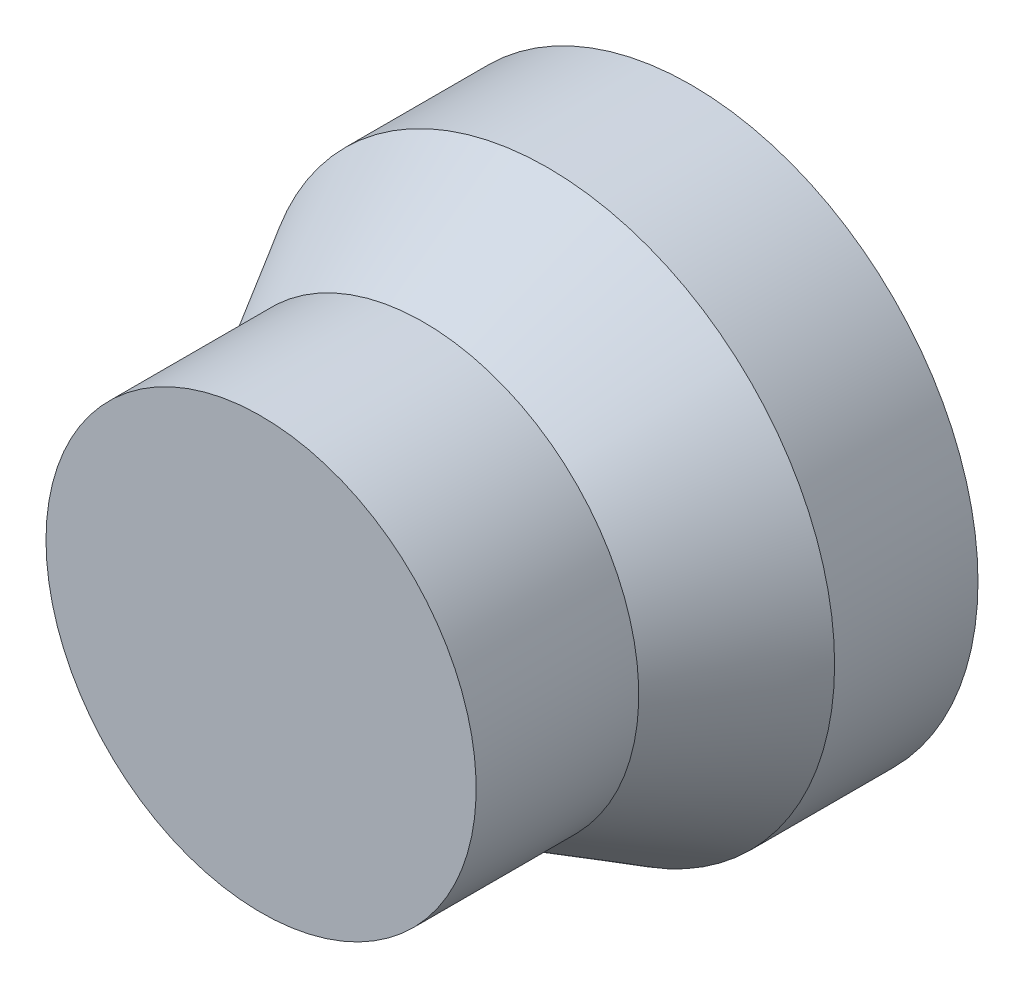
ISO-10303-21;
HEADER;
FILE_DESCRIPTION(('STEP AP214'),'2;1');
FILE_NAME('part.step','',(''),(''),'','','');
FILE_SCHEMA(('AUTOMOTIVE_DESIGN { 1 0 10303 214 1 1 1 1 }'));
ENDSEC;
DATA;
#1=APPLICATION_CONTEXT('core data for automotive mechanical design processes');
#2=APPLICATION_PROTOCOL_DEFINITION('international standard','automotive_design',2000,#1);
#3=PRODUCT_CONTEXT('',#1,'mechanical');
#4=PRODUCT('Part','Part','',(#3));
#5=PRODUCT_RELATED_PRODUCT_CATEGORY('part','',(#4));
#6=PRODUCT_DEFINITION_FORMATION('','',#4);
#7=PRODUCT_DEFINITION_CONTEXT('part definition',#1,'design');
#8=PRODUCT_DEFINITION('design','',#6,#7);
#9=PRODUCT_DEFINITION_SHAPE('','',#8);
#10=(LENGTH_UNIT() NAMED_UNIT(*) SI_UNIT(.MILLI.,.METRE.));
#11=(NAMED_UNIT(*) PLANE_ANGLE_UNIT() SI_UNIT($,.RADIAN.));
#12=(NAMED_UNIT(*) SI_UNIT($,.STERADIAN.) SOLID_ANGLE_UNIT());
#13=UNCERTAINTY_MEASURE_WITH_UNIT(LENGTH_MEASURE(1.E-05),#10,'distance_accuracy_value','');
#14=(GEOMETRIC_REPRESENTATION_CONTEXT(3) GLOBAL_UNCERTAINTY_ASSIGNED_CONTEXT((#13)) GLOBAL_UNIT_ASSIGNED_CONTEXT((#10,
#11,#12)) REPRESENTATION_CONTEXT('',''));
#15=CARTESIAN_POINT('',(0.,0.,0.));
#16=DIRECTION('',(0.,0.,1.));
#17=DIRECTION('',(1.,0.,0.));
#18=AXIS2_PLACEMENT_3D('',#15,#16,#17);
#19=CARTESIAN_POINT('',(0.,0.,150.));
#20=DIRECTION('',(0.,0.,-1.));
#21=DIRECTION('',(-1.,0.,0.));
#22=AXIS2_PLACEMENT_3D('',#19,#20,#21);
#23=PLANE('',#22);
#24=CARTESIAN_POINT('',(0.,0.,150.));
#25=DIRECTION('',(0.,0.,-1.));
#26=DIRECTION('',(-1.,0.,0.));
#27=AXIS2_PLACEMENT_3D('',#24,#25,#26);
#28=CIRCLE('',#27,75.);
#29=CARTESIAN_POINT('',(-75.,0.,150.));
#30=VERTEX_POINT('',#29);
#31=EDGE_CURVE('E10',#30,#30,#28,.T.);
#32=ORIENTED_EDGE('',*,*,#31,.F.);
#33=EDGE_LOOP('',(#32));
#34=FACE_BOUND('',#33,.T.);
#35=ADVANCED_FACE('F35',(#34),#23,.F.);
#36=CARTESIAN_POINT('',(0.,0.,-165.573770491803));
#37=DIRECTION('',(0.,0.,-1.));
#38=DIRECTION('',(-1.,0.,0.));
#39=AXIS2_PLACEMENT_3D('',#36,#37,#38);
#40=CYLINDRICAL_SURFACE('',#39,75.);
#41=CARTESIAN_POINT('',(0.,0.,93.3012701892219));
#42=DIRECTION('',(0.,0.,-1.));
#43=DIRECTION('',(-1.,0.,0.));
#44=AXIS2_PLACEMENT_3D('',#41,#42,#43);
#45=CIRCLE('',#44,75.);
#46=CARTESIAN_POINT('',(-75.,0.,93.3012701892219));
#47=VERTEX_POINT('',#46);
#48=EDGE_CURVE('E41',#47,#47,#45,.T.);
#49=ORIENTED_EDGE('',*,*,#48,.F.);
#50=EDGE_LOOP('',(#49));
#51=FACE_BOUND('',#50,.T.);
#52=ORIENTED_EDGE('',*,*,#31,.T.);
#53=EDGE_LOOP('',(#52));
#54=FACE_BOUND('',#53,.T.);
#55=ADVANCED_FACE('F65',(#51,#54),#40,.T.);
#56=CARTESIAN_POINT('',(0.,0.,93.3012701892219));
#57=DIRECTION('',(0.,0.,-1.));
#58=DIRECTION('',(-1.,0.,0.));
#59=AXIS2_PLACEMENT_3D('',#56,#57,#58);
#60=CONICAL_SURFACE('',#59,75.,0.523598775598299);
#61=CARTESIAN_POINT('',(0.,0.,50.));
#62=DIRECTION('',(0.,0.,-1.));
#63=DIRECTION('',(-1.,0.,0.));
#64=AXIS2_PLACEMENT_3D('',#61,#62,#63);
#65=CIRCLE('',#64,100.);
#66=CARTESIAN_POINT('',(-100.,0.,50.));
#67=VERTEX_POINT('',#66);
#68=EDGE_CURVE('E45',#67,#67,#65,.T.);
#69=ORIENTED_EDGE('',*,*,#68,.F.);
#70=EDGE_LOOP('',(#69));
#71=FACE_BOUND('',#70,.T.);
#72=ORIENTED_EDGE('',*,*,#48,.T.);
#73=EDGE_LOOP('',(#72));
#74=FACE_BOUND('',#73,.T.);
#75=ADVANCED_FACE('F60',(#71,#74),#60,.T.);
#76=CARTESIAN_POINT('',(0.,0.,-165.573770491803));
#77=DIRECTION('',(0.,0.,-1.));
#78=DIRECTION('',(-1.,0.,0.));
#79=AXIS2_PLACEMENT_3D('',#76,#77,#78);
#80=CYLINDRICAL_SURFACE('',#79,100.);
#81=CARTESIAN_POINT('',(0.,0.,0.));
#82=DIRECTION('',(0.,0.,-1.));
#83=DIRECTION('',(-1.,0.,0.));
#84=AXIS2_PLACEMENT_3D('',#81,#82,#83);
#85=CIRCLE('',#84,100.);
#86=CARTESIAN_POINT('',(-100.,0.,0.));
#87=VERTEX_POINT('',#86);
#88=EDGE_CURVE('E49',#87,#87,#85,.T.);
#89=ORIENTED_EDGE('',*,*,#88,.F.);
#90=EDGE_LOOP('',(#89));
#91=FACE_BOUND('',#90,.T.);
#92=ORIENTED_EDGE('',*,*,#68,.T.);
#93=EDGE_LOOP('',(#92));
#94=FACE_BOUND('',#93,.T.);
#95=ADVANCED_FACE('F57',(#91,#94),#80,.T.);
#96=CARTESIAN_POINT('',(100.,0.,0.));
#97=DIRECTION('',(0.,0.,1.));
#98=DIRECTION('',(1.,0.,0.));
#99=AXIS2_PLACEMENT_3D('',#96,#97,#98);
#100=PLANE('',#99);
#101=ORIENTED_EDGE('',*,*,#88,.T.);
#102=EDGE_LOOP('',(#101));
#103=FACE_BOUND('',#102,.T.);
#104=ADVANCED_FACE('F55',(#103),#100,.F.);
#105=CLOSED_SHELL('',(#35,#55,#75,#95,#104));
#106=MANIFOLD_SOLID_BREP('B2',#105);
#107=ADVANCED_BREP_SHAPE_REPRESENTATION('',(#18,#106),#14);
#108=SHAPE_DEFINITION_REPRESENTATION(#9,#107);
ENDSEC;
END-ISO-10303-21;
